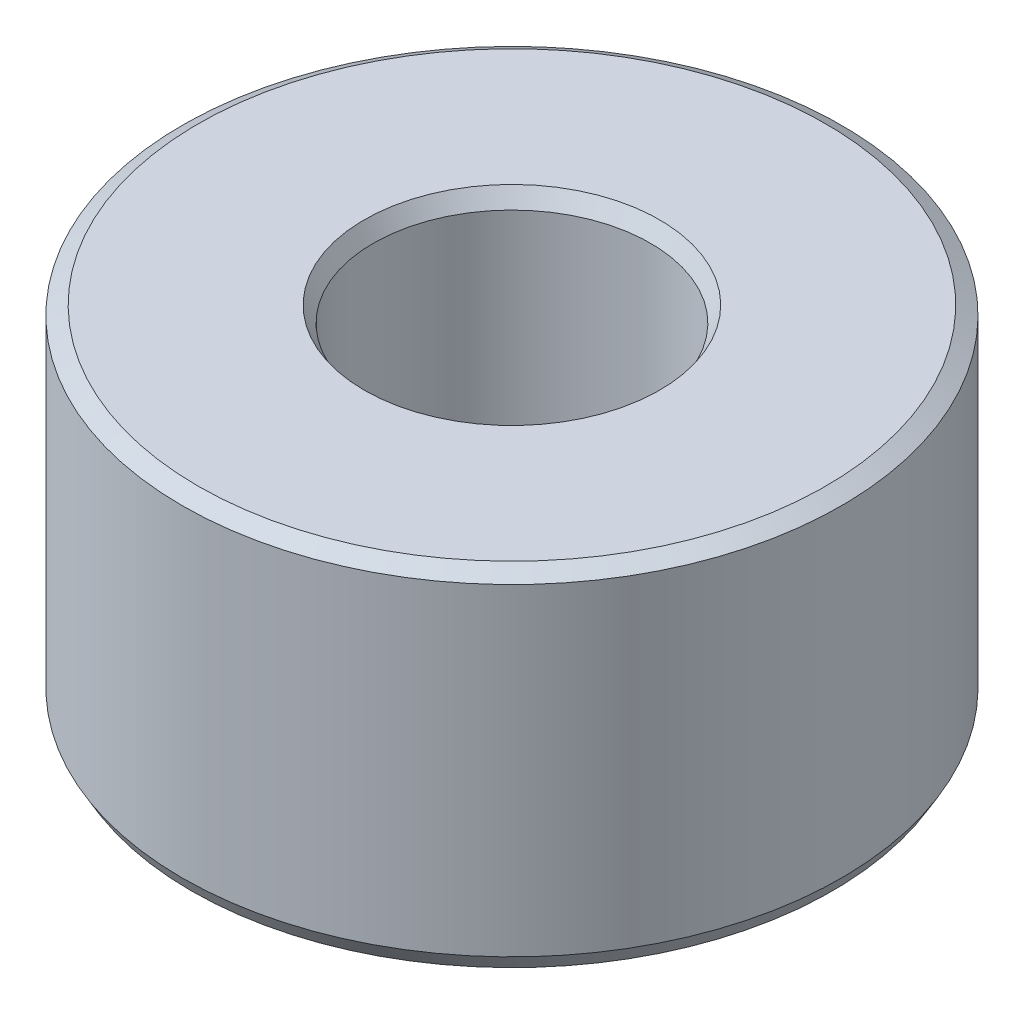
ISO-10303-21;
HEADER;
FILE_DESCRIPTION(('STEP AP214'),'2;1');
FILE_NAME('part.step','',(''),(''),'','','');
FILE_SCHEMA(('AUTOMOTIVE_DESIGN { 1 0 10303 214 1 1 1 1 }'));
ENDSEC;
DATA;
#1=APPLICATION_CONTEXT('core data for automotive mechanical design processes');
#2=APPLICATION_PROTOCOL_DEFINITION('international standard','automotive_design',2000,#1);
#3=PRODUCT_CONTEXT('',#1,'mechanical');
#4=PRODUCT('Part','Part','',(#3));
#5=PRODUCT_RELATED_PRODUCT_CATEGORY('part','',(#4));
#6=PRODUCT_DEFINITION_FORMATION('','',#4);
#7=PRODUCT_DEFINITION_CONTEXT('part definition',#1,'design');
#8=PRODUCT_DEFINITION('design','',#6,#7);
#9=PRODUCT_DEFINITION_SHAPE('','',#8);
#10=(LENGTH_UNIT() NAMED_UNIT(*) SI_UNIT(.MILLI.,.METRE.));
#11=(NAMED_UNIT(*) PLANE_ANGLE_UNIT() SI_UNIT($,.RADIAN.));
#12=(NAMED_UNIT(*) SI_UNIT($,.STERADIAN.) SOLID_ANGLE_UNIT());
#13=UNCERTAINTY_MEASURE_WITH_UNIT(LENGTH_MEASURE(1.E-05),#10,'distance_accuracy_value','');
#14=(GEOMETRIC_REPRESENTATION_CONTEXT(3) GLOBAL_UNCERTAINTY_ASSIGNED_CONTEXT((#13)) GLOBAL_UNIT_ASSIGNED_CONTEXT((#10,
#11,#12)) REPRESENTATION_CONTEXT('',''));
#15=CARTESIAN_POINT('',(0.,0.,0.));
#16=DIRECTION('',(0.,0.,1.));
#17=DIRECTION('',(1.,0.,0.));
#18=AXIS2_PLACEMENT_3D('',#15,#16,#17);
#19=CARTESIAN_POINT('',(0.,57.9521958024731,0.));
#20=DIRECTION('',(0.,-1.,0.));
#21=DIRECTION('',(0.,0.,-1.));
#22=AXIS2_PLACEMENT_3D('',#19,#20,#21);
#23=CYLINDRICAL_SURFACE('',#22,55.);
#24=CARTESIAN_POINT('',(0.,2.62884022974694,0.));
#25=DIRECTION('',(0.,1.,0.));
#26=DIRECTION('',(0.,0.,1.));
#27=AXIS2_PLACEMENT_3D('',#24,#25,#26);
#28=CIRCLE('',#27,55.);
#29=CARTESIAN_POINT('',(0.,2.62884022974694,55.));
#30=VERTEX_POINT('',#29);
#31=EDGE_CURVE('E10',#30,#30,#28,.T.);
#32=ORIENTED_EDGE('',*,*,#31,.T.);
#33=EDGE_LOOP('',(#32));
#34=FACE_BOUND('',#33,.T.);
#35=CARTESIAN_POINT('',(0.,56.4344341881722,0.));
#36=DIRECTION('',(0.,1.,0.));
#37=DIRECTION('',(0.,0.,1.));
#38=AXIS2_PLACEMENT_3D('',#35,#36,#37);
#39=CIRCLE('',#38,55.);
#40=CARTESIAN_POINT('',(0.,56.4344341881722,55.));
#41=VERTEX_POINT('',#40);
#42=EDGE_CURVE('E50',#41,#41,#39,.F.);
#43=ORIENTED_EDGE('',*,*,#42,.T.);
#44=EDGE_LOOP('',(#43));
#45=FACE_BOUND('',#44,.T.);
#46=ADVANCED_FACE('F39',(#34,#45),#23,.T.);
#47=CARTESIAN_POINT('',(0.,57.9521958024731,0.));
#48=DIRECTION('',(0.,1.,0.));
#49=DIRECTION('',(0.,0.,1.));
#50=AXIS2_PLACEMENT_3D('',#47,#48,#49);
#51=PLANE('',#50);
#52=CARTESIAN_POINT('',(0.,57.9521958024731,0.));
#53=DIRECTION('',(0.,1.,0.));
#54=DIRECTION('',(0.,0.,1.));
#55=AXIS2_PLACEMENT_3D('',#52,#53,#54);
#56=CIRCLE('',#55,24.6421649607646);
#57=CARTESIAN_POINT('',(0.,57.9521958024731,24.6421649607646));
#58=VERTEX_POINT('',#57);
#59=EDGE_CURVE('E58',#58,#58,#56,.F.);
#60=ORIENTED_EDGE('',*,*,#59,.T.);
#61=EDGE_LOOP('',(#60));
#62=FACE_BOUND('',#61,.T.);
#63=CARTESIAN_POINT('',(0.,57.9521958024731,0.));
#64=DIRECTION('',(0.,1.,0.));
#65=DIRECTION('',(0.,0.,1.));
#66=AXIS2_PLACEMENT_3D('',#63,#64,#65);
#67=CIRCLE('',#66,52.3711597702531);
#68=CARTESIAN_POINT('',(0.,57.9521958024731,52.3711597702531));
#69=VERTEX_POINT('',#68);
#70=EDGE_CURVE('E61',#69,#69,#67,.T.);
#71=ORIENTED_EDGE('',*,*,#70,.T.);
#72=EDGE_LOOP('',(#71));
#73=FACE_BOUND('',#72,.T.);
#74=ADVANCED_FACE('F88',(#62,#73),#51,.T.);
#75=CARTESIAN_POINT('',(0.,0.,0.));
#76=DIRECTION('',(0.,1.,0.));
#77=DIRECTION('',(0.,0.,1.));
#78=AXIS2_PLACEMENT_3D('',#75,#76,#77);
#79=PLANE('',#78);
#80=CARTESIAN_POINT('',(0.,0.,0.));
#81=DIRECTION('',(0.,1.,0.));
#82=DIRECTION('',(0.,0.,1.));
#83=AXIS2_PLACEMENT_3D('',#80,#81,#82);
#84=CIRCLE('',#83,25.7532435762105);
#85=CARTESIAN_POINT('',(0.,0.,25.7532435762105));
#86=VERTEX_POINT('',#85);
#87=EDGE_CURVE('E51',#86,#86,#84,.T.);
#88=ORIENTED_EDGE('',*,*,#87,.T.);
#89=EDGE_LOOP('',(#88));
#90=FACE_BOUND('',#89,.T.);
#91=CARTESIAN_POINT('',(0.,0.,0.));
#92=DIRECTION('',(0.,1.,0.));
#93=DIRECTION('',(0.,0.,1.));
#94=AXIS2_PLACEMENT_3D('',#91,#92,#93);
#95=CIRCLE('',#94,53.4822383856991);
#96=CARTESIAN_POINT('',(0.,0.,53.4822383856991));
#97=VERTEX_POINT('',#96);
#98=EDGE_CURVE('E54',#97,#97,#95,.F.);
#99=ORIENTED_EDGE('',*,*,#98,.T.);
#100=EDGE_LOOP('',(#99));
#101=FACE_BOUND('',#100,.T.);
#102=ADVANCED_FACE('F83',(#90,#101),#79,.F.);
#103=CARTESIAN_POINT('',(0.,57.9521958024731,0.));
#104=DIRECTION('',(0.,-1.,0.));
#105=DIRECTION('',(0.,0.,-1.));
#106=AXIS2_PLACEMENT_3D('',#103,#104,#105);
#107=CYLINDRICAL_SURFACE('',#106,23.1244033464636);
#108=CARTESIAN_POINT('',(0.,55.3233555727262,0.));
#109=DIRECTION('',(0.,1.,0.));
#110=DIRECTION('',(0.,0.,1.));
#111=AXIS2_PLACEMENT_3D('',#108,#109,#110);
#112=CIRCLE('',#111,23.1244033464636);
#113=CARTESIAN_POINT('',(0.,55.3233555727262,23.1244033464636));
#114=VERTEX_POINT('',#113);
#115=EDGE_CURVE('E67',#114,#114,#112,.T.);
#116=ORIENTED_EDGE('',*,*,#115,.T.);
#117=EDGE_LOOP('',(#116));
#118=FACE_BOUND('',#117,.T.);
#119=CARTESIAN_POINT('',(0.,1.51776161430092,0.));
#120=DIRECTION('',(0.,1.,0.));
#121=DIRECTION('',(0.,0.,1.));
#122=AXIS2_PLACEMENT_3D('',#119,#120,#121);
#123=CIRCLE('',#122,23.1244033464636);
#124=CARTESIAN_POINT('',(0.,1.51776161430092,23.1244033464636));
#125=VERTEX_POINT('',#124);
#126=EDGE_CURVE('E69',#125,#125,#123,.F.);
#127=ORIENTED_EDGE('',*,*,#126,.T.);
#128=EDGE_LOOP('',(#127));
#129=FACE_BOUND('',#128,.T.);
#130=ADVANCED_FACE('F71',(#118,#129),#107,.F.);
#131=CARTESIAN_POINT('',(0.,55.3233555727262,0.));
#132=DIRECTION('',(0.,1.,0.));
#133=DIRECTION('',(0.,0.,1.));
#134=AXIS2_PLACEMENT_3D('',#131,#132,#133);
#135=CONICAL_SURFACE('',#134,23.1244033464636,0.523598775598306);
#136=ORIENTED_EDGE('',*,*,#59,.F.);
#137=EDGE_LOOP('',(#136));
#138=FACE_BOUND('',#137,.T.);
#139=ORIENTED_EDGE('',*,*,#115,.F.);
#140=EDGE_LOOP('',(#139));
#141=FACE_BOUND('',#140,.T.);
#142=ADVANCED_FACE('F77',(#138,#141),#135,.F.);
#143=CARTESIAN_POINT('',(0.,0.,0.));
#144=DIRECTION('',(0.,-1.,0.));
#145=DIRECTION('',(0.,0.,-1.));
#146=AXIS2_PLACEMENT_3D('',#143,#144,#145);
#147=CONICAL_SURFACE('',#146,25.7532435762105,1.04719755119659);
#148=ORIENTED_EDGE('',*,*,#126,.F.);
#149=EDGE_LOOP('',(#148));
#150=FACE_BOUND('',#149,.T.);
#151=ORIENTED_EDGE('',*,*,#87,.F.);
#152=EDGE_LOOP('',(#151));
#153=FACE_BOUND('',#152,.T.);
#154=ADVANCED_FACE('F73',(#150,#153),#147,.F.);
#155=CARTESIAN_POINT('',(0.,2.62884022974694,0.));
#156=DIRECTION('',(0.,1.,0.));
#157=DIRECTION('',(0.,0.,1.));
#158=AXIS2_PLACEMENT_3D('',#155,#156,#157);
#159=CONICAL_SURFACE('',#158,55.,0.523598775598304);
#160=ORIENTED_EDGE('',*,*,#98,.F.);
#161=EDGE_LOOP('',(#160));
#162=FACE_BOUND('',#161,.T.);
#163=ORIENTED_EDGE('',*,*,#31,.F.);
#164=EDGE_LOOP('',(#163));
#165=FACE_BOUND('',#164,.T.);
#166=ADVANCED_FACE('F76',(#162,#165),#159,.T.);
#167=CARTESIAN_POINT('',(0.,57.9521958024731,0.));
#168=DIRECTION('',(0.,-1.,0.));
#169=DIRECTION('',(0.,0.,-1.));
#170=AXIS2_PLACEMENT_3D('',#167,#168,#169);
#171=CONICAL_SURFACE('',#170,52.3711597702531,1.04719755119659);
#172=ORIENTED_EDGE('',*,*,#42,.F.);
#173=EDGE_LOOP('',(#172));
#174=FACE_BOUND('',#173,.T.);
#175=ORIENTED_EDGE('',*,*,#70,.F.);
#176=EDGE_LOOP('',(#175));
#177=FACE_BOUND('',#176,.T.);
#178=ADVANCED_FACE('F45',(#174,#177),#171,.T.);
#179=CLOSED_SHELL('',(#46,#74,#102,#130,#142,#154,#166,#178));
#180=MANIFOLD_SOLID_BREP('B2',#179);
#181=ADVANCED_BREP_SHAPE_REPRESENTATION('',(#18,#180),#14);
#182=SHAPE_DEFINITION_REPRESENTATION(#9,#181);
ENDSEC;
END-ISO-10303-21;
